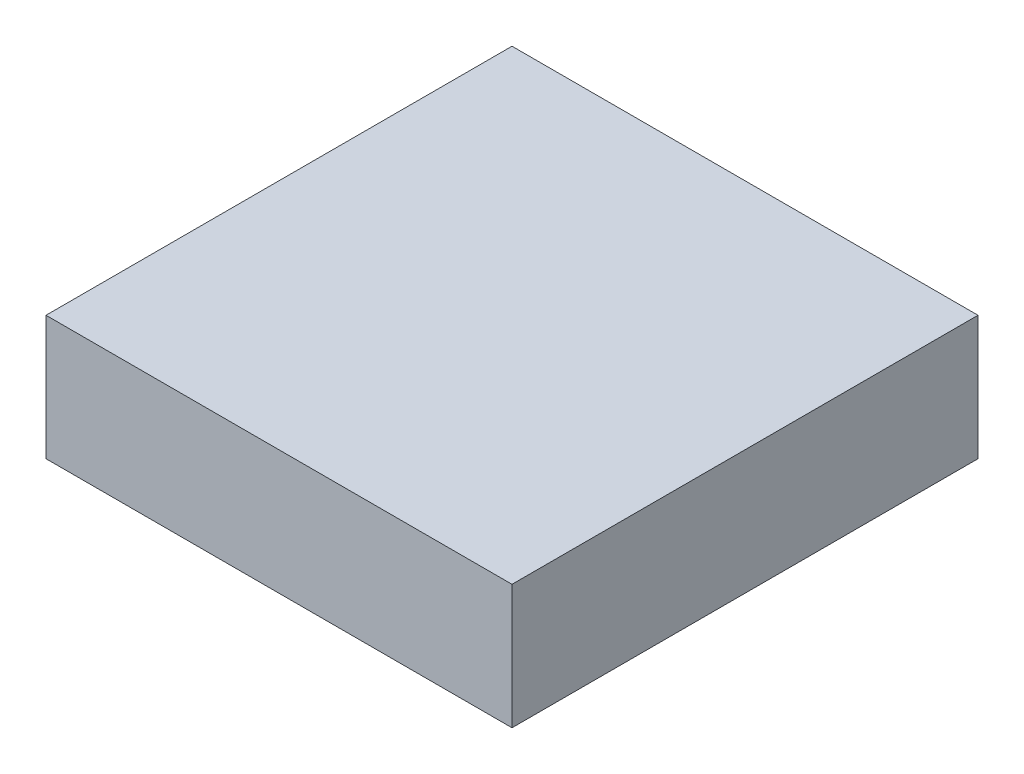
ISO-10303-21;
HEADER;
FILE_DESCRIPTION(('STEP AP214'),'2;1');
FILE_NAME('part.step','',(''),(''),'','','');
FILE_SCHEMA(('AUTOMOTIVE_DESIGN { 1 0 10303 214 1 1 1 1 }'));
ENDSEC;
DATA;
#1=APPLICATION_CONTEXT('core data for automotive mechanical design processes');
#2=APPLICATION_PROTOCOL_DEFINITION('international standard','automotive_design',2000,#1);
#3=PRODUCT_CONTEXT('',#1,'mechanical');
#4=PRODUCT('Part','Part','',(#3));
#5=PRODUCT_RELATED_PRODUCT_CATEGORY('part','',(#4));
#6=PRODUCT_DEFINITION_FORMATION('','',#4);
#7=PRODUCT_DEFINITION_CONTEXT('part definition',#1,'design');
#8=PRODUCT_DEFINITION('design','',#6,#7);
#9=PRODUCT_DEFINITION_SHAPE('','',#8);
#10=(LENGTH_UNIT() NAMED_UNIT(*) SI_UNIT(.MILLI.,.METRE.));
#11=(NAMED_UNIT(*) PLANE_ANGLE_UNIT() SI_UNIT($,.RADIAN.));
#12=(NAMED_UNIT(*) SI_UNIT($,.STERADIAN.) SOLID_ANGLE_UNIT());
#13=UNCERTAINTY_MEASURE_WITH_UNIT(LENGTH_MEASURE(1.E-05),#10,'distance_accuracy_value','');
#14=(GEOMETRIC_REPRESENTATION_CONTEXT(3) GLOBAL_UNCERTAINTY_ASSIGNED_CONTEXT((#13)) GLOBAL_UNIT_ASSIGNED_CONTEXT((#10,
#11,#12)) REPRESENTATION_CONTEXT('',''));
#15=CARTESIAN_POINT('',(0.,0.,0.));
#16=DIRECTION('',(0.,0.,1.));
#17=DIRECTION('',(1.,0.,0.));
#18=AXIS2_PLACEMENT_3D('',#15,#16,#17);
#19=CARTESIAN_POINT('',(0.,0.8,-3.));
#20=DIRECTION('',(1.,0.,0.));
#21=DIRECTION('',(0.,0.,-1.));
#22=AXIS2_PLACEMENT_3D('',#19,#20,#21);
#23=PLANE('',#22);
#24=DIRECTION('',(0.,0.,1.));
#25=VECTOR('',#24,1.);
#26=CARTESIAN_POINT('',(0.,0.,-3.));
#27=LINE('',#26,#25);
#28=CARTESIAN_POINT('',(0.,0.,-3.));
#29=VERTEX_POINT('',#28);
#30=CARTESIAN_POINT('',(0.,0.,0.));
#31=VERTEX_POINT('',#30);
#32=EDGE_CURVE('E101',#29,#31,#27,.T.);
#33=ORIENTED_EDGE('',*,*,#32,.T.);
#34=DIRECTION('',(0.,-1.,0.));
#35=VECTOR('',#34,1.);
#36=CARTESIAN_POINT('',(0.,0.8,0.));
#37=LINE('',#36,#35);
#38=CARTESIAN_POINT('',(0.,0.8,0.));
#39=VERTEX_POINT('',#38);
#40=EDGE_CURVE('E11',#39,#31,#37,.T.);
#41=ORIENTED_EDGE('',*,*,#40,.F.);
#42=DIRECTION('',(0.,0.,1.));
#43=VECTOR('',#42,1.);
#44=CARTESIAN_POINT('',(0.,0.8,-3.));
#45=LINE('',#44,#43);
#46=CARTESIAN_POINT('',(0.,0.8,-3.));
#47=VERTEX_POINT('',#46);
#48=EDGE_CURVE('E89',#47,#39,#45,.T.);
#49=ORIENTED_EDGE('',*,*,#48,.F.);
#50=DIRECTION('',(0.,-1.,0.));
#51=VECTOR('',#50,1.);
#52=CARTESIAN_POINT('',(0.,0.8,-3.));
#53=LINE('',#52,#51);
#54=EDGE_CURVE('E97',#47,#29,#53,.T.);
#55=ORIENTED_EDGE('',*,*,#54,.T.);
#56=EDGE_LOOP('',(#33,#41,#49,#55));
#57=FACE_BOUND('',#56,.T.);
#58=ADVANCED_FACE('F38',(#57),#23,.F.);
#59=CARTESIAN_POINT('',(0.,0.8,0.));
#60=DIRECTION('',(0.,0.,-1.));
#61=DIRECTION('',(-1.,0.,0.));
#62=AXIS2_PLACEMENT_3D('',#59,#60,#61);
#63=PLANE('',#62);
#64=DIRECTION('',(1.,0.,0.));
#65=VECTOR('',#64,1.);
#66=CARTESIAN_POINT('',(0.,0.,0.));
#67=LINE('',#66,#65);
#68=CARTESIAN_POINT('',(3.,0.,0.));
#69=VERTEX_POINT('',#68);
#70=EDGE_CURVE('E93',#31,#69,#67,.T.);
#71=ORIENTED_EDGE('',*,*,#70,.T.);
#72=DIRECTION('',(0.,-1.,0.));
#73=VECTOR('',#72,1.);
#74=CARTESIAN_POINT('',(3.,0.8,0.));
#75=LINE('',#74,#73);
#76=CARTESIAN_POINT('',(3.,0.8,0.));
#77=VERTEX_POINT('',#76);
#78=EDGE_CURVE('E46',#77,#69,#75,.T.);
#79=ORIENTED_EDGE('',*,*,#78,.F.);
#80=DIRECTION('',(1.,0.,0.));
#81=VECTOR('',#80,1.);
#82=CARTESIAN_POINT('',(0.,0.8,0.));
#83=LINE('',#82,#81);
#84=EDGE_CURVE('E84',#39,#77,#83,.T.);
#85=ORIENTED_EDGE('',*,*,#84,.F.);
#86=ORIENTED_EDGE('',*,*,#40,.T.);
#87=EDGE_LOOP('',(#71,#79,#85,#86));
#88=FACE_BOUND('',#87,.T.);
#89=ADVANCED_FACE('F92',(#88),#63,.F.);
#90=CARTESIAN_POINT('',(3.,0.8,-3.));
#91=DIRECTION('',(-1.,0.,0.));
#92=DIRECTION('',(0.,0.,1.));
#93=AXIS2_PLACEMENT_3D('',#90,#91,#92);
#94=PLANE('',#93);
#95=DIRECTION('',(0.,0.,-1.));
#96=VECTOR('',#95,1.);
#97=CARTESIAN_POINT('',(3.,0.,-3.));
#98=LINE('',#97,#96);
#99=CARTESIAN_POINT('',(3.,0.,-3.));
#100=VERTEX_POINT('',#99);
#101=EDGE_CURVE('E71',#69,#100,#98,.T.);
#102=ORIENTED_EDGE('',*,*,#101,.T.);
#103=DIRECTION('',(0.,-1.,0.));
#104=VECTOR('',#103,1.);
#105=CARTESIAN_POINT('',(3.,0.8,-3.));
#106=LINE('',#105,#104);
#107=CARTESIAN_POINT('',(3.,0.8,-3.));
#108=VERTEX_POINT('',#107);
#109=EDGE_CURVE('E94',#108,#100,#106,.T.);
#110=ORIENTED_EDGE('',*,*,#109,.F.);
#111=DIRECTION('',(0.,0.,-1.));
#112=VECTOR('',#111,1.);
#113=CARTESIAN_POINT('',(3.,0.8,-3.));
#114=LINE('',#113,#112);
#115=EDGE_CURVE('E87',#77,#108,#114,.T.);
#116=ORIENTED_EDGE('',*,*,#115,.F.);
#117=ORIENTED_EDGE('',*,*,#78,.T.);
#118=EDGE_LOOP('',(#102,#110,#116,#117));
#119=FACE_BOUND('',#118,.T.);
#120=ADVANCED_FACE('F95',(#119),#94,.F.);
#121=CARTESIAN_POINT('',(0.,0.8,-3.));
#122=DIRECTION('',(0.,0.,1.));
#123=DIRECTION('',(1.,0.,0.));
#124=AXIS2_PLACEMENT_3D('',#121,#122,#123);
#125=PLANE('',#124);
#126=DIRECTION('',(-1.,0.,0.));
#127=VECTOR('',#126,1.);
#128=CARTESIAN_POINT('',(0.,0.,-3.));
#129=LINE('',#128,#127);
#130=EDGE_CURVE('E77',#100,#29,#129,.T.);
#131=ORIENTED_EDGE('',*,*,#130,.T.);
#132=ORIENTED_EDGE('',*,*,#54,.F.);
#133=DIRECTION('',(-1.,0.,0.));
#134=VECTOR('',#133,1.);
#135=CARTESIAN_POINT('',(0.,0.8,-3.));
#136=LINE('',#135,#134);
#137=EDGE_CURVE('E54',#108,#47,#136,.T.);
#138=ORIENTED_EDGE('',*,*,#137,.F.);
#139=ORIENTED_EDGE('',*,*,#109,.T.);
#140=EDGE_LOOP('',(#131,#132,#138,#139));
#141=FACE_BOUND('',#140,.T.);
#142=ADVANCED_FACE('F108',(#141),#125,.F.);
#143=CARTESIAN_POINT('',(0.,0.8,0.));
#144=DIRECTION('',(0.,1.,0.));
#145=DIRECTION('',(0.,0.,1.));
#146=AXIS2_PLACEMENT_3D('',#143,#144,#145);
#147=PLANE('',#146);
#148=ORIENTED_EDGE('',*,*,#48,.T.);
#149=ORIENTED_EDGE('',*,*,#84,.T.);
#150=ORIENTED_EDGE('',*,*,#115,.T.);
#151=ORIENTED_EDGE('',*,*,#137,.T.);
#152=EDGE_LOOP('',(#148,#149,#150,#151));
#153=FACE_BOUND('',#152,.T.);
#154=ADVANCED_FACE('F85',(#153),#147,.T.);
#155=CARTESIAN_POINT('',(0.,0.,0.));
#156=DIRECTION('',(0.,1.,0.));
#157=DIRECTION('',(0.,0.,1.));
#158=AXIS2_PLACEMENT_3D('',#155,#156,#157);
#159=PLANE('',#158);
#160=ORIENTED_EDGE('',*,*,#32,.F.);
#161=ORIENTED_EDGE('',*,*,#130,.F.);
#162=ORIENTED_EDGE('',*,*,#101,.F.);
#163=ORIENTED_EDGE('',*,*,#70,.F.);
#164=EDGE_LOOP('',(#160,#161,#162,#163));
#165=FACE_BOUND('',#164,.T.);
#166=ADVANCED_FACE('F111',(#165),#159,.F.);
#167=CLOSED_SHELL('',(#58,#89,#120,#142,#154,#166));
#168=MANIFOLD_SOLID_BREP('B2',#167);
#169=ADVANCED_BREP_SHAPE_REPRESENTATION('',(#18,#168),#14);
#170=SHAPE_DEFINITION_REPRESENTATION(#9,#169);
ENDSEC;
END-ISO-10303-21;
